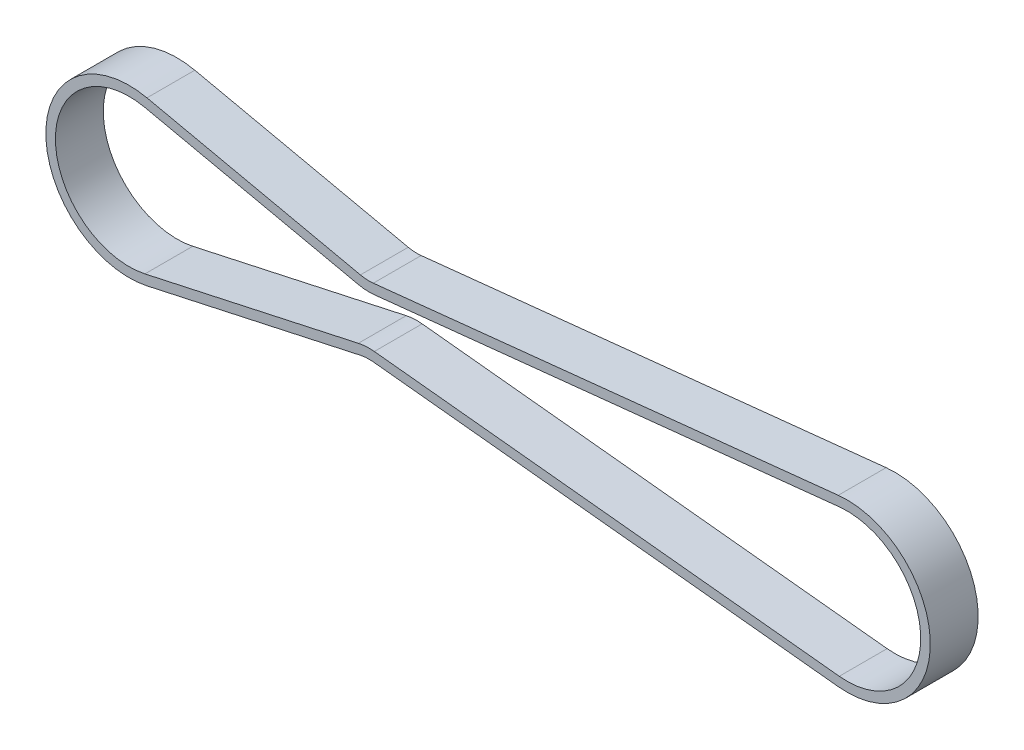
ISO-10303-21;
HEADER;
FILE_DESCRIPTION(('STEP AP214'),'2;1');
FILE_NAME('part.step','',(''),(''),'','','');
FILE_SCHEMA(('AUTOMOTIVE_DESIGN { 1 0 10303 214 1 1 1 1 }'));
ENDSEC;
DATA;
#1=APPLICATION_CONTEXT('core data for automotive mechanical design processes');
#2=APPLICATION_PROTOCOL_DEFINITION('international standard','automotive_design',2000,#1);
#3=PRODUCT_CONTEXT('',#1,'mechanical');
#4=PRODUCT('Part','Part','',(#3));
#5=PRODUCT_RELATED_PRODUCT_CATEGORY('part','',(#4));
#6=PRODUCT_DEFINITION_FORMATION('','',#4);
#7=PRODUCT_DEFINITION_CONTEXT('part definition',#1,'design');
#8=PRODUCT_DEFINITION('design','',#6,#7);
#9=PRODUCT_DEFINITION_SHAPE('','',#8);
#10=(LENGTH_UNIT() NAMED_UNIT(*) SI_UNIT(.MILLI.,.METRE.));
#11=(NAMED_UNIT(*) PLANE_ANGLE_UNIT() SI_UNIT($,.RADIAN.));
#12=(NAMED_UNIT(*) SI_UNIT($,.STERADIAN.) SOLID_ANGLE_UNIT());
#13=UNCERTAINTY_MEASURE_WITH_UNIT(LENGTH_MEASURE(1.E-05),#10,'distance_accuracy_value','');
#14=(GEOMETRIC_REPRESENTATION_CONTEXT(3) GLOBAL_UNCERTAINTY_ASSIGNED_CONTEXT((#13)) GLOBAL_UNIT_ASSIGNED_CONTEXT((#10,
#11,#12)) REPRESENTATION_CONTEXT('',''));
#15=CARTESIAN_POINT('',(0.,0.,0.));
#16=DIRECTION('',(0.,0.,1.));
#17=DIRECTION('',(1.,0.,0.));
#18=AXIS2_PLACEMENT_3D('',#15,#16,#17);
#19=CARTESIAN_POINT('',(75.,-3.60822483003176E-13,81.5));
#20=DIRECTION('',(0.,0.,1.));
#21=DIRECTION('',(1.,0.,0.));
#22=AXIS2_PLACEMENT_3D('',#19,#20,#21);
#23=PLANE('',#22);
#24=CARTESIAN_POINT('',(0.,-3.60822483003176E-13,81.5));
#25=DIRECTION('',(0.,0.,1.));
#26=DIRECTION('',(1.,0.,0.));
#27=AXIS2_PLACEMENT_3D('',#24,#25,#26);
#28=CIRCLE('',#27,15.4154943091896);
#29=CARTESIAN_POINT('',(3.28935340807219,15.0604654295094,81.5));
#30=VERTEX_POINT('',#29);
#31=CARTESIAN_POINT('',(3.28935340807243,-15.0604654295101,81.5));
#32=VERTEX_POINT('',#31);
#33=EDGE_CURVE('E309',#30,#32,#28,.T.);
#34=ORIENTED_EDGE('',*,*,#33,.F.);
#35=DIRECTION('',(0.976969348334933,-0.21337969072528,0.));
#36=VECTOR('',#35,1.);
#37=CARTESIAN_POINT('',(29.547447914767,9.32543997101072,81.5));
#38=LINE('',#37,#36);
#39=CARTESIAN_POINT('',(47.8889567423,5.31947449448388,81.5));
#40=VERTEX_POINT('',#39);
#41=EDGE_CURVE('E303',#30,#40,#38,.T.);
#42=ORIENTED_EDGE('',*,*,#41,.T.);
#43=CARTESIAN_POINT('',(50.1294434949154,15.5776526520007,81.5));
#44=DIRECTION('',(0.,0.,1.));
#45=DIRECTION('',(1.,0.,0.));
#46=AXIS2_PLACEMENT_3D('',#43,#44,#45);
#47=CIRCLE('',#46,10.5);
#48=CARTESIAN_POINT('',(51.2252674029766,5.13499159446742,81.5));
#49=VERTEX_POINT('',#48);
#50=EDGE_CURVE('E226',#40,#49,#47,.T.);
#51=ORIENTED_EDGE('',*,*,#50,.T.);
#52=DIRECTION('',(0.9945391483365,0.104364181720111,0.));
#53=VECTOR('',#52,1.);
#54=CARTESIAN_POINT('',(95.7787422666862,9.81030976039052,81.5));
#55=LINE('',#54,#53);
#56=CARTESIAN_POINT('',(148.39117455061,15.3313125814466,81.5));
#57=VERTEX_POINT('',#56);
#58=EDGE_CURVE('E240',#49,#57,#55,.T.);
#59=ORIENTED_EDGE('',*,*,#58,.T.);
#60=CARTESIAN_POINT('',(150.,-1.29368512012869E-12,81.5));
#61=DIRECTION('',(0.,0.,1.));
#62=DIRECTION('',(1.,0.,0.));
#63=AXIS2_PLACEMENT_3D('',#60,#61,#62);
#64=CIRCLE('',#63,15.4154943091899);
#65=CARTESIAN_POINT('',(148.39117455061,-15.3313125814491,81.5));
#66=VERTEX_POINT('',#65);
#67=EDGE_CURVE('E316',#66,#57,#64,.T.);
#68=ORIENTED_EDGE('',*,*,#67,.F.);
#69=DIRECTION('',(0.994539148336498,-0.104364181720138,0.));
#70=VECTOR('',#69,1.);
#71=CARTESIAN_POINT('',(95.7787422666862,-9.81030976039172,81.5));
#72=LINE('',#71,#70);
#73=CARTESIAN_POINT('',(51.2252674029769,-5.13499159446817,81.5));
#74=VERTEX_POINT('',#73);
#75=EDGE_CURVE('E272',#74,#66,#72,.T.);
#76=ORIENTED_EDGE('',*,*,#75,.F.);
#77=CARTESIAN_POINT('',(50.1294434949154,-15.5776526520014,81.5));
#78=DIRECTION('',(0.,0.,1.));
#79=DIRECTION('',(1.,0.,0.));
#80=AXIS2_PLACEMENT_3D('',#77,#78,#79);
#81=CIRCLE('',#80,10.5);
#82=CARTESIAN_POINT('',(47.8889567422998,-5.31947449448463,81.5));
#83=VERTEX_POINT('',#82);
#84=EDGE_CURVE('E245',#74,#83,#81,.T.);
#85=ORIENTED_EDGE('',*,*,#84,.T.);
#86=DIRECTION('',(0.97696934833493,0.213379690725295,0.));
#87=VECTOR('',#86,1.);
#88=CARTESIAN_POINT('',(29.547447914767,-9.32543997101101,81.5));
#89=LINE('',#88,#87);
#90=EDGE_CURVE('E28',#32,#83,#89,.T.);
#91=ORIENTED_EDGE('',*,*,#90,.F.);
#92=EDGE_LOOP('',(#34,#42,#51,#59,#68,#76,#85,#91));
#93=FACE_BOUND('',#92,.T.);
#94=DIRECTION('',(0.976969348334933,-0.21337969072528,0.));
#95=VECTOR('',#94,1.);
#96=CARTESIAN_POINT('',(23.0046926909625,12.801589035395,81.5));
#97=LINE('',#96,#95);
#98=CARTESIAN_POINT('',(3.71611278952282,17.0144041261797,81.5));
#99=VERTEX_POINT('',#98);
#100=CARTESIAN_POINT('',(48.3157161237505,7.27341319115447,81.5));
#101=VERTEX_POINT('',#100);
#102=EDGE_CURVE('E257',#99,#101,#97,.T.);
#103=ORIENTED_EDGE('',*,*,#102,.F.);
#104=CARTESIAN_POINT('',(0.,-3.58021368059133E-13,81.5));
#105=DIRECTION('',(0.,0.,1.));
#106=DIRECTION('',(1.,0.,0.));
#107=AXIS2_PLACEMENT_3D('',#104,#105,#106);
#108=CIRCLE('',#107,17.4154943091899);
#109=CARTESIAN_POINT('',(3.71611278952257,-17.0144041261793,81.5));
#110=VERTEX_POINT('',#109);
#111=EDGE_CURVE('E222',#99,#110,#108,.T.);
#112=ORIENTED_EDGE('',*,*,#111,.T.);
#113=DIRECTION('',(0.976969348334933,0.21337969072528,0.));
#114=VECTOR('',#113,1.);
#115=CARTESIAN_POINT('',(23.0046926909629,-12.8015890353949,81.5));
#116=LINE('',#115,#114);
#117=CARTESIAN_POINT('',(48.3157161237505,-7.27341319115447,81.5));
#118=VERTEX_POINT('',#117);
#119=EDGE_CURVE('E82',#110,#118,#116,.T.);
#120=ORIENTED_EDGE('',*,*,#119,.T.);
#121=CARTESIAN_POINT('',(50.1294434949154,-15.5776526520015,81.5));
#122=DIRECTION('',(0.,0.,1.));
#123=DIRECTION('',(1.,0.,0.));
#124=AXIS2_PLACEMENT_3D('',#121,#122,#123);
#125=CIRCLE('',#124,8.5);
#126=CARTESIAN_POINT('',(51.0165390395363,-7.12406989114114,81.5));
#127=VERTEX_POINT('',#126);
#128=EDGE_CURVE('E194',#127,#118,#125,.T.);
#129=ORIENTED_EDGE('',*,*,#128,.F.);
#130=DIRECTION('',(0.994539148336501,-0.104364181720108,0.));
#131=VECTOR('',#130,1.);
#132=CARTESIAN_POINT('',(102.664868139607,-12.5439023962321,81.5));
#133=LINE('',#132,#131);
#134=CARTESIAN_POINT('',(148.18244618717,-17.3203908781192,81.5));
#135=VERTEX_POINT('',#134);
#136=EDGE_CURVE('E180',#127,#135,#133,.T.);
#137=ORIENTED_EDGE('',*,*,#136,.T.);
#138=CARTESIAN_POINT('',(150.,-1.35236849515905E-12,81.5));
#139=DIRECTION('',(0.,0.,1.));
#140=DIRECTION('',(1.,0.,0.));
#141=AXIS2_PLACEMENT_3D('',#138,#139,#140);
#142=CIRCLE('',#141,17.4154943091899);
#143=CARTESIAN_POINT('',(148.18244618717,17.3203908781196,81.5));
#144=VERTEX_POINT('',#143);
#145=EDGE_CURVE('E254',#135,#144,#142,.T.);
#146=ORIENTED_EDGE('',*,*,#145,.T.);
#147=DIRECTION('',(0.994539148336501,0.104364181720108,0.));
#148=VECTOR('',#147,1.);
#149=CARTESIAN_POINT('',(102.664868139607,12.5439023962322,81.5));
#150=LINE('',#149,#148);
#151=CARTESIAN_POINT('',(51.0165390395363,7.12406989114042,81.5));
#152=VERTEX_POINT('',#151);
#153=EDGE_CURVE('E216',#152,#144,#150,.T.);
#154=ORIENTED_EDGE('',*,*,#153,.F.);
#155=CARTESIAN_POINT('',(50.1294434949154,15.5776526520008,81.5));
#156=DIRECTION('',(0.,0.,-1.));
#157=DIRECTION('',(1.,0.,0.));
#158=AXIS2_PLACEMENT_3D('',#155,#156,#157);
#159=CIRCLE('',#158,8.5);
#160=EDGE_CURVE('E333',#152,#101,#159,.T.);
#161=ORIENTED_EDGE('',*,*,#160,.T.);
#162=EDGE_LOOP('',(#103,#112,#120,#129,#137,#146,#154,#161));
#163=FACE_BOUND('',#162,.T.);
#164=ADVANCED_FACE('F17',(#93,#163),#23,.T.);
#165=CARTESIAN_POINT('',(75.,-3.60822483003176E-13,71.5));
#166=DIRECTION('',(0.,0.,1.));
#167=DIRECTION('',(1.,0.,0.));
#168=AXIS2_PLACEMENT_3D('',#165,#166,#167);
#169=PLANE('',#168);
#170=CARTESIAN_POINT('',(0.,-3.60822483003176E-13,71.5));
#171=DIRECTION('',(0.,0.,1.));
#172=DIRECTION('',(1.,0.,0.));
#173=AXIS2_PLACEMENT_3D('',#170,#171,#172);
#174=CIRCLE('',#173,15.4154943091896);
#175=CARTESIAN_POINT('',(3.28935340807219,15.0604654295094,71.5));
#176=VERTEX_POINT('',#175);
#177=CARTESIAN_POINT('',(3.28935340807243,-15.0604654295101,71.5));
#178=VERTEX_POINT('',#177);
#179=EDGE_CURVE('E294',#176,#178,#174,.T.);
#180=ORIENTED_EDGE('',*,*,#179,.T.);
#181=DIRECTION('',(0.97696934833493,0.213379690725295,0.));
#182=VECTOR('',#181,1.);
#183=CARTESIAN_POINT('',(29.547447914767,-9.32543997101101,71.5));
#184=LINE('',#183,#182);
#185=CARTESIAN_POINT('',(47.8889567422998,-5.31947449448463,71.5));
#186=VERTEX_POINT('',#185);
#187=EDGE_CURVE('E11',#178,#186,#184,.T.);
#188=ORIENTED_EDGE('',*,*,#187,.T.);
#189=CARTESIAN_POINT('',(50.1294434949154,-15.5776526520014,71.5));
#190=DIRECTION('',(0.,0.,1.));
#191=DIRECTION('',(1.,0.,0.));
#192=AXIS2_PLACEMENT_3D('',#189,#190,#191);
#193=CIRCLE('',#192,10.5);
#194=CARTESIAN_POINT('',(51.2252674029769,-5.13499159446817,71.5));
#195=VERTEX_POINT('',#194);
#196=EDGE_CURVE('E249',#195,#186,#193,.T.);
#197=ORIENTED_EDGE('',*,*,#196,.F.);
#198=DIRECTION('',(0.994539148336498,-0.104364181720138,0.));
#199=VECTOR('',#198,1.);
#200=CARTESIAN_POINT('',(95.7787422666862,-9.81030976039172,71.5));
#201=LINE('',#200,#199);
#202=CARTESIAN_POINT('',(148.39117455061,-15.3313125814491,71.5));
#203=VERTEX_POINT('',#202);
#204=EDGE_CURVE('E284',#195,#203,#201,.T.);
#205=ORIENTED_EDGE('',*,*,#204,.T.);
#206=CARTESIAN_POINT('',(150.,-1.29368512012869E-12,71.5));
#207=DIRECTION('',(0.,0.,1.));
#208=DIRECTION('',(1.,0.,0.));
#209=AXIS2_PLACEMENT_3D('',#206,#207,#208);
#210=CIRCLE('',#209,15.4154943091899);
#211=CARTESIAN_POINT('',(148.39117455061,15.3313125814466,71.5));
#212=VERTEX_POINT('',#211);
#213=EDGE_CURVE('E273',#203,#212,#210,.T.);
#214=ORIENTED_EDGE('',*,*,#213,.T.);
#215=DIRECTION('',(0.9945391483365,0.104364181720111,0.));
#216=VECTOR('',#215,1.);
#217=CARTESIAN_POINT('',(95.7787422666862,9.81030976039052,71.5));
#218=LINE('',#217,#216);
#219=CARTESIAN_POINT('',(51.2252674029766,5.13499159446742,71.5));
#220=VERTEX_POINT('',#219);
#221=EDGE_CURVE('E235',#220,#212,#218,.T.);
#222=ORIENTED_EDGE('',*,*,#221,.F.);
#223=CARTESIAN_POINT('',(50.1294434949154,15.5776526520007,71.5));
#224=DIRECTION('',(0.,0.,1.));
#225=DIRECTION('',(1.,0.,0.));
#226=AXIS2_PLACEMENT_3D('',#223,#224,#225);
#227=CIRCLE('',#226,10.5);
#228=CARTESIAN_POINT('',(47.8889567423,5.31947449448388,71.5));
#229=VERTEX_POINT('',#228);
#230=EDGE_CURVE('E230',#229,#220,#227,.T.);
#231=ORIENTED_EDGE('',*,*,#230,.F.);
#232=DIRECTION('',(0.976969348334933,-0.21337969072528,0.));
#233=VECTOR('',#232,1.);
#234=CARTESIAN_POINT('',(29.547447914767,9.32543997101072,71.5));
#235=LINE('',#234,#233);
#236=EDGE_CURVE('E299',#176,#229,#235,.T.);
#237=ORIENTED_EDGE('',*,*,#236,.F.);
#238=EDGE_LOOP('',(#180,#188,#197,#205,#214,#222,#231,#237));
#239=FACE_BOUND('',#238,.T.);
#240=DIRECTION('',(0.976969348334933,-0.21337969072528,0.));
#241=VECTOR('',#240,1.);
#242=CARTESIAN_POINT('',(23.0046926909625,12.801589035395,71.5));
#243=LINE('',#242,#241);
#244=CARTESIAN_POINT('',(3.71611278952282,17.0144041261797,71.5));
#245=VERTEX_POINT('',#244);
#246=CARTESIAN_POINT('',(48.3157161237505,7.27341319115447,71.5));
#247=VERTEX_POINT('',#246);
#248=EDGE_CURVE('E223',#245,#247,#243,.T.);
#249=ORIENTED_EDGE('',*,*,#248,.T.);
#250=CARTESIAN_POINT('',(50.1294434949154,15.5776526520008,71.5));
#251=DIRECTION('',(0.,0.,-1.));
#252=DIRECTION('',(1.,0.,0.));
#253=AXIS2_PLACEMENT_3D('',#250,#251,#252);
#254=CIRCLE('',#253,8.5);
#255=CARTESIAN_POINT('',(51.0165390395363,7.12406989114042,71.5));
#256=VERTEX_POINT('',#255);
#257=EDGE_CURVE('E42',#256,#247,#254,.T.);
#258=ORIENTED_EDGE('',*,*,#257,.F.);
#259=DIRECTION('',(0.994539148336501,0.104364181720108,0.));
#260=VECTOR('',#259,1.);
#261=CARTESIAN_POINT('',(102.664868139607,12.5439023962322,71.5));
#262=LINE('',#261,#260);
#263=CARTESIAN_POINT('',(148.18244618717,17.3203908781196,71.5));
#264=VERTEX_POINT('',#263);
#265=EDGE_CURVE('E234',#256,#264,#262,.T.);
#266=ORIENTED_EDGE('',*,*,#265,.T.);
#267=CARTESIAN_POINT('',(150.,-1.35236849515905E-12,71.5));
#268=DIRECTION('',(0.,0.,1.));
#269=DIRECTION('',(1.,0.,0.));
#270=AXIS2_PLACEMENT_3D('',#267,#268,#269);
#271=CIRCLE('',#270,17.4154943091899);
#272=CARTESIAN_POINT('',(148.18244618717,-17.3203908781192,71.5));
#273=VERTEX_POINT('',#272);
#274=EDGE_CURVE('E217',#273,#264,#271,.T.);
#275=ORIENTED_EDGE('',*,*,#274,.F.);
#276=DIRECTION('',(0.994539148336501,-0.104364181720108,0.));
#277=VECTOR('',#276,1.);
#278=CARTESIAN_POINT('',(102.664868139607,-12.5439023962321,71.5));
#279=LINE('',#278,#277);
#280=CARTESIAN_POINT('',(51.0165390395363,-7.12406989114114,71.5));
#281=VERTEX_POINT('',#280);
#282=EDGE_CURVE('E190',#281,#273,#279,.T.);
#283=ORIENTED_EDGE('',*,*,#282,.F.);
#284=CARTESIAN_POINT('',(50.1294434949154,-15.5776526520015,71.5));
#285=DIRECTION('',(0.,0.,1.));
#286=DIRECTION('',(1.,0.,0.));
#287=AXIS2_PLACEMENT_3D('',#284,#285,#286);
#288=CIRCLE('',#287,8.5);
#289=CARTESIAN_POINT('',(48.3157161237505,-7.27341319115447,71.5));
#290=VERTEX_POINT('',#289);
#291=EDGE_CURVE('E171',#281,#290,#288,.T.);
#292=ORIENTED_EDGE('',*,*,#291,.T.);
#293=DIRECTION('',(0.976969348334933,0.21337969072528,0.));
#294=VECTOR('',#293,1.);
#295=CARTESIAN_POINT('',(23.0046926909629,-12.8015890353949,71.5));
#296=LINE('',#295,#294);
#297=CARTESIAN_POINT('',(3.71611278952257,-17.0144041261793,71.5));
#298=VERTEX_POINT('',#297);
#299=EDGE_CURVE('E208',#298,#290,#296,.T.);
#300=ORIENTED_EDGE('',*,*,#299,.F.);
#301=CARTESIAN_POINT('',(0.,-3.58021368059133E-13,71.5));
#302=DIRECTION('',(0.,0.,1.));
#303=DIRECTION('',(1.,0.,0.));
#304=AXIS2_PLACEMENT_3D('',#301,#302,#303);
#305=CIRCLE('',#304,17.4154943091899);
#306=EDGE_CURVE('E96',#245,#298,#305,.T.);
#307=ORIENTED_EDGE('',*,*,#306,.F.);
#308=EDGE_LOOP('',(#249,#258,#266,#275,#283,#292,#300,#307));
#309=FACE_BOUND('',#308,.T.);
#310=ADVANCED_FACE('F354',(#239,#309),#169,.F.);
#311=CARTESIAN_POINT('',(29.547447914767,-9.32543997101101,71.5));
#312=DIRECTION('',(0.213379690725295,-0.97696934833493,0.));
#313=DIRECTION('',(0.,0.,-1.));
#314=AXIS2_PLACEMENT_3D('',#311,#312,#313);
#315=PLANE('',#314);
#316=ORIENTED_EDGE('',*,*,#90,.T.);
#317=DIRECTION('',(0.,0.,1.));
#318=VECTOR('',#317,1.);
#319=CARTESIAN_POINT('',(47.8889567422998,-5.31947449448463,71.5));
#320=LINE('',#319,#318);
#321=EDGE_CURVE('E262',#186,#83,#320,.T.);
#322=ORIENTED_EDGE('',*,*,#321,.F.);
#323=ORIENTED_EDGE('',*,*,#187,.F.);
#324=DIRECTION('',(0.,0.,1.));
#325=VECTOR('',#324,1.);
#326=CARTESIAN_POINT('',(3.28935340807243,-15.0604654295101,71.5));
#327=LINE('',#326,#325);
#328=EDGE_CURVE('E21',#178,#32,#327,.T.);
#329=ORIENTED_EDGE('',*,*,#328,.T.);
#330=EDGE_LOOP('',(#316,#322,#323,#329));
#331=FACE_BOUND('',#330,.T.);
#332=ADVANCED_FACE('F414',(#331),#315,.F.);
#333=CARTESIAN_POINT('',(50.1294434949154,15.5776526520008,71.5));
#334=DIRECTION('',(0.,0.,1.));
#335=DIRECTION('',(1.,0.,0.));
#336=AXIS2_PLACEMENT_3D('',#333,#334,#335);
#337=CYLINDRICAL_SURFACE('',#336,8.5);
#338=ORIENTED_EDGE('',*,*,#160,.F.);
#339=DIRECTION('',(0.,0.,1.));
#340=VECTOR('',#339,1.);
#341=CARTESIAN_POINT('',(51.0165390395363,7.12406989114042,71.5));
#342=LINE('',#341,#340);
#343=EDGE_CURVE('E281',#256,#152,#342,.T.);
#344=ORIENTED_EDGE('',*,*,#343,.F.);
#345=ORIENTED_EDGE('',*,*,#257,.T.);
#346=DIRECTION('',(0.,0.,1.));
#347=VECTOR('',#346,1.);
#348=CARTESIAN_POINT('',(48.3157161237505,7.27341319115447,71.5));
#349=LINE('',#348,#347);
#350=EDGE_CURVE('E261',#247,#101,#349,.T.);
#351=ORIENTED_EDGE('',*,*,#350,.T.);
#352=EDGE_LOOP('',(#338,#344,#345,#351));
#353=FACE_BOUND('',#352,.T.);
#354=ADVANCED_FACE('F419',(#353),#337,.F.);
#355=CARTESIAN_POINT('',(102.664868139607,12.5439023962322,71.5));
#356=DIRECTION('',(0.104364181720108,-0.994539148336501,0.));
#357=DIRECTION('',(0.,0.,-1.));
#358=AXIS2_PLACEMENT_3D('',#355,#356,#357);
#359=PLANE('',#358);
#360=ORIENTED_EDGE('',*,*,#153,.T.);
#361=DIRECTION('',(0.,0.,1.));
#362=VECTOR('',#361,1.);
#363=CARTESIAN_POINT('',(148.18244618717,17.3203908781196,71.5));
#364=LINE('',#363,#362);
#365=EDGE_CURVE('E213',#264,#144,#364,.T.);
#366=ORIENTED_EDGE('',*,*,#365,.F.);
#367=ORIENTED_EDGE('',*,*,#265,.F.);
#368=ORIENTED_EDGE('',*,*,#343,.T.);
#369=EDGE_LOOP('',(#360,#366,#367,#368));
#370=FACE_BOUND('',#369,.T.);
#371=ADVANCED_FACE('F451',(#370),#359,.F.);
#372=CARTESIAN_POINT('',(150.,-1.35236849515905E-12,71.5));
#373=DIRECTION('',(0.,0.,1.));
#374=DIRECTION('',(1.,0.,0.));
#375=AXIS2_PLACEMENT_3D('',#372,#373,#374);
#376=CYLINDRICAL_SURFACE('',#375,17.4154943091899);
#377=ORIENTED_EDGE('',*,*,#145,.F.);
#378=DIRECTION('',(0.,0.,1.));
#379=VECTOR('',#378,1.);
#380=CARTESIAN_POINT('',(148.18244618717,-17.3203908781192,71.5));
#381=LINE('',#380,#379);
#382=EDGE_CURVE('E185',#273,#135,#381,.T.);
#383=ORIENTED_EDGE('',*,*,#382,.F.);
#384=ORIENTED_EDGE('',*,*,#274,.T.);
#385=ORIENTED_EDGE('',*,*,#365,.T.);
#386=EDGE_LOOP('',(#377,#383,#384,#385));
#387=FACE_BOUND('',#386,.T.);
#388=ADVANCED_FACE('F500',(#387),#376,.T.);
#389=CARTESIAN_POINT('',(102.664868139607,-12.5439023962321,71.5));
#390=DIRECTION('',(-0.104364181720108,-0.994539148336501,0.));
#391=DIRECTION('',(-0.994539148336501,0.104364181720108,0.));
#392=AXIS2_PLACEMENT_3D('',#389,#390,#391);
#393=PLANE('',#392);
#394=ORIENTED_EDGE('',*,*,#136,.F.);
#395=DIRECTION('',(0.,0.,1.));
#396=VECTOR('',#395,1.);
#397=CARTESIAN_POINT('',(51.0165390395363,-7.12406989114114,71.5));
#398=LINE('',#397,#396);
#399=EDGE_CURVE('E183',#281,#127,#398,.T.);
#400=ORIENTED_EDGE('',*,*,#399,.F.);
#401=ORIENTED_EDGE('',*,*,#282,.T.);
#402=ORIENTED_EDGE('',*,*,#382,.T.);
#403=EDGE_LOOP('',(#394,#400,#401,#402));
#404=FACE_BOUND('',#403,.T.);
#405=ADVANCED_FACE('F19',(#404),#393,.T.);
#406=CARTESIAN_POINT('',(50.1294434949154,-15.5776526520015,71.5));
#407=DIRECTION('',(0.,0.,1.));
#408=DIRECTION('',(1.,0.,0.));
#409=AXIS2_PLACEMENT_3D('',#406,#407,#408);
#410=CYLINDRICAL_SURFACE('',#409,8.5);
#411=ORIENTED_EDGE('',*,*,#128,.T.);
#412=DIRECTION('',(0.,0.,1.));
#413=VECTOR('',#412,1.);
#414=CARTESIAN_POINT('',(48.3157161237505,-7.27341319115447,71.5));
#415=LINE('',#414,#413);
#416=EDGE_CURVE('E200',#290,#118,#415,.T.);
#417=ORIENTED_EDGE('',*,*,#416,.F.);
#418=ORIENTED_EDGE('',*,*,#291,.F.);
#419=ORIENTED_EDGE('',*,*,#399,.T.);
#420=EDGE_LOOP('',(#411,#417,#418,#419));
#421=FACE_BOUND('',#420,.T.);
#422=ADVANCED_FACE('F193',(#421),#410,.F.);
#423=CARTESIAN_POINT('',(23.0046926909629,-12.8015890353949,71.5));
#424=DIRECTION('',(0.21337969072528,-0.976969348334933,0.));
#425=DIRECTION('',(0.,0.,-1.));
#426=AXIS2_PLACEMENT_3D('',#423,#424,#425);
#427=PLANE('',#426);
#428=ORIENTED_EDGE('',*,*,#119,.F.);
#429=DIRECTION('',(0.,0.,1.));
#430=VECTOR('',#429,1.);
#431=CARTESIAN_POINT('',(3.71611278952257,-17.0144041261793,71.5));
#432=LINE('',#431,#430);
#433=EDGE_CURVE('E274',#298,#110,#432,.T.);
#434=ORIENTED_EDGE('',*,*,#433,.F.);
#435=ORIENTED_EDGE('',*,*,#299,.T.);
#436=ORIENTED_EDGE('',*,*,#416,.T.);
#437=EDGE_LOOP('',(#428,#434,#435,#436));
#438=FACE_BOUND('',#437,.T.);
#439=ADVANCED_FACE('F403',(#438),#427,.T.);
#440=CARTESIAN_POINT('',(0.,-3.58021368059133E-13,71.5));
#441=DIRECTION('',(0.,0.,1.));
#442=DIRECTION('',(1.,0.,0.));
#443=AXIS2_PLACEMENT_3D('',#440,#441,#442);
#444=CYLINDRICAL_SURFACE('',#443,17.4154943091899);
#445=ORIENTED_EDGE('',*,*,#111,.F.);
#446=DIRECTION('',(0.,0.,1.));
#447=VECTOR('',#446,1.);
#448=CARTESIAN_POINT('',(3.71611278952282,17.0144041261797,71.5));
#449=LINE('',#448,#447);
#450=EDGE_CURVE('E218',#245,#99,#449,.T.);
#451=ORIENTED_EDGE('',*,*,#450,.F.);
#452=ORIENTED_EDGE('',*,*,#306,.T.);
#453=ORIENTED_EDGE('',*,*,#433,.T.);
#454=EDGE_LOOP('',(#445,#451,#452,#453));
#455=FACE_BOUND('',#454,.T.);
#456=ADVANCED_FACE('F408',(#455),#444,.T.);
#457=CARTESIAN_POINT('',(23.0046926909625,12.801589035395,71.5));
#458=DIRECTION('',(-0.21337969072528,-0.976969348334933,0.));
#459=DIRECTION('',(-0.976969348334933,0.21337969072528,0.));
#460=AXIS2_PLACEMENT_3D('',#457,#458,#459);
#461=PLANE('',#460);
#462=ORIENTED_EDGE('',*,*,#102,.T.);
#463=ORIENTED_EDGE('',*,*,#350,.F.);
#464=ORIENTED_EDGE('',*,*,#248,.F.);
#465=ORIENTED_EDGE('',*,*,#450,.T.);
#466=EDGE_LOOP('',(#462,#463,#464,#465));
#467=FACE_BOUND('',#466,.T.);
#468=ADVANCED_FACE('F435',(#467),#461,.F.);
#469=CARTESIAN_POINT('',(50.1294434949154,-15.5776526520014,71.5));
#470=DIRECTION('',(0.,0.,1.));
#471=DIRECTION('',(1.,0.,0.));
#472=AXIS2_PLACEMENT_3D('',#469,#470,#471);
#473=CYLINDRICAL_SURFACE('',#472,10.5);
#474=ORIENTED_EDGE('',*,*,#84,.F.);
#475=DIRECTION('',(0.,0.,1.));
#476=VECTOR('',#475,1.);
#477=CARTESIAN_POINT('',(51.2252674029769,-5.13499159446817,71.5));
#478=LINE('',#477,#476);
#479=EDGE_CURVE('E250',#195,#74,#478,.T.);
#480=ORIENTED_EDGE('',*,*,#479,.F.);
#481=ORIENTED_EDGE('',*,*,#196,.T.);
#482=ORIENTED_EDGE('',*,*,#321,.T.);
#483=EDGE_LOOP('',(#474,#480,#481,#482));
#484=FACE_BOUND('',#483,.T.);
#485=ADVANCED_FACE('F386',(#484),#473,.T.);
#486=CARTESIAN_POINT('',(95.7787422666862,-9.81030976039172,71.5));
#487=DIRECTION('',(-0.104364181720138,-0.994539148336498,0.));
#488=DIRECTION('',(-0.994539148336498,0.104364181720138,0.));
#489=AXIS2_PLACEMENT_3D('',#486,#487,#488);
#490=PLANE('',#489);
#491=ORIENTED_EDGE('',*,*,#75,.T.);
#492=DIRECTION('',(0.,0.,1.));
#493=VECTOR('',#492,1.);
#494=CARTESIAN_POINT('',(148.39117455061,-15.3313125814491,71.5));
#495=LINE('',#494,#493);
#496=EDGE_CURVE('E268',#203,#66,#495,.T.);
#497=ORIENTED_EDGE('',*,*,#496,.F.);
#498=ORIENTED_EDGE('',*,*,#204,.F.);
#499=ORIENTED_EDGE('',*,*,#479,.T.);
#500=EDGE_LOOP('',(#491,#497,#498,#499));
#501=FACE_BOUND('',#500,.T.);
#502=ADVANCED_FACE('F381',(#501),#490,.F.);
#503=CARTESIAN_POINT('',(150.,-1.29368512012869E-12,71.5));
#504=DIRECTION('',(0.,0.,1.));
#505=DIRECTION('',(1.,0.,0.));
#506=AXIS2_PLACEMENT_3D('',#503,#504,#505);
#507=CYLINDRICAL_SURFACE('',#506,15.4154943091899);
#508=ORIENTED_EDGE('',*,*,#67,.T.);
#509=DIRECTION('',(0.,0.,1.));
#510=VECTOR('',#509,1.);
#511=CARTESIAN_POINT('',(148.39117455061,15.3313125814466,71.5));
#512=LINE('',#511,#510);
#513=EDGE_CURVE('E239',#212,#57,#512,.T.);
#514=ORIENTED_EDGE('',*,*,#513,.F.);
#515=ORIENTED_EDGE('',*,*,#213,.F.);
#516=ORIENTED_EDGE('',*,*,#496,.T.);
#517=EDGE_LOOP('',(#508,#514,#515,#516));
#518=FACE_BOUND('',#517,.T.);
#519=ADVANCED_FACE('F359',(#518),#507,.F.);
#520=CARTESIAN_POINT('',(95.7787422666862,9.81030976039052,71.5));
#521=DIRECTION('',(0.104364181720111,-0.9945391483365,0.));
#522=DIRECTION('',(0.,0.,-1.));
#523=AXIS2_PLACEMENT_3D('',#520,#521,#522);
#524=PLANE('',#523);
#525=ORIENTED_EDGE('',*,*,#58,.F.);
#526=DIRECTION('',(0.,0.,1.));
#527=VECTOR('',#526,1.);
#528=CARTESIAN_POINT('',(51.2252674029766,5.13499159446742,71.5));
#529=LINE('',#528,#527);
#530=EDGE_CURVE('E241',#220,#49,#529,.T.);
#531=ORIENTED_EDGE('',*,*,#530,.F.);
#532=ORIENTED_EDGE('',*,*,#221,.T.);
#533=ORIENTED_EDGE('',*,*,#513,.T.);
#534=EDGE_LOOP('',(#525,#531,#532,#533));
#535=FACE_BOUND('',#534,.T.);
#536=ADVANCED_FACE('F363',(#535),#524,.T.);
#537=CARTESIAN_POINT('',(50.1294434949154,15.5776526520007,71.5));
#538=DIRECTION('',(0.,0.,1.));
#539=DIRECTION('',(1.,0.,0.));
#540=AXIS2_PLACEMENT_3D('',#537,#538,#539);
#541=CYLINDRICAL_SURFACE('',#540,10.5);
#542=ORIENTED_EDGE('',*,*,#50,.F.);
#543=DIRECTION('',(0.,0.,1.));
#544=VECTOR('',#543,1.);
#545=CARTESIAN_POINT('',(47.8889567423,5.31947449448388,71.5));
#546=LINE('',#545,#544);
#547=EDGE_CURVE('E231',#229,#40,#546,.T.);
#548=ORIENTED_EDGE('',*,*,#547,.F.);
#549=ORIENTED_EDGE('',*,*,#230,.T.);
#550=ORIENTED_EDGE('',*,*,#530,.T.);
#551=EDGE_LOOP('',(#542,#548,#549,#550));
#552=FACE_BOUND('',#551,.T.);
#553=ADVANCED_FACE('F366',(#552),#541,.T.);
#554=CARTESIAN_POINT('',(29.547447914767,9.32543997101072,71.5));
#555=DIRECTION('',(-0.21337969072528,-0.976969348334933,0.));
#556=DIRECTION('',(-0.976969348334933,0.21337969072528,0.));
#557=AXIS2_PLACEMENT_3D('',#554,#555,#556);
#558=PLANE('',#557);
#559=ORIENTED_EDGE('',*,*,#41,.F.);
#560=DIRECTION('',(0.,0.,1.));
#561=VECTOR('',#560,1.);
#562=CARTESIAN_POINT('',(3.28935340807219,15.0604654295094,71.5));
#563=LINE('',#562,#561);
#564=EDGE_CURVE('E298',#176,#30,#563,.T.);
#565=ORIENTED_EDGE('',*,*,#564,.F.);
#566=ORIENTED_EDGE('',*,*,#236,.T.);
#567=ORIENTED_EDGE('',*,*,#547,.T.);
#568=EDGE_LOOP('',(#559,#565,#566,#567));
#569=FACE_BOUND('',#568,.T.);
#570=ADVANCED_FACE('F371',(#569),#558,.T.);
#571=CARTESIAN_POINT('',(0.,-3.60822483003176E-13,71.5));
#572=DIRECTION('',(0.,0.,1.));
#573=DIRECTION('',(1.,0.,0.));
#574=AXIS2_PLACEMENT_3D('',#571,#572,#573);
#575=CYLINDRICAL_SURFACE('',#574,15.4154943091896);
#576=ORIENTED_EDGE('',*,*,#33,.T.);
#577=ORIENTED_EDGE('',*,*,#328,.F.);
#578=ORIENTED_EDGE('',*,*,#179,.F.);
#579=ORIENTED_EDGE('',*,*,#564,.T.);
#580=EDGE_LOOP('',(#576,#577,#578,#579));
#581=FACE_BOUND('',#580,.T.);
#582=ADVANCED_FACE('F374',(#581),#575,.F.);
#583=CLOSED_SHELL('',(#164,#310,#332,#354,#371,#388,#405,#422,#439,#456,#468,#485,#502,#519,
#536,#553,#570,#582));
#584=MANIFOLD_SOLID_BREP('B1',#583);
#585=ADVANCED_BREP_SHAPE_REPRESENTATION('',(#18,#584),#14);
#586=SHAPE_DEFINITION_REPRESENTATION(#9,#585);
ENDSEC;
END-ISO-10303-21;
